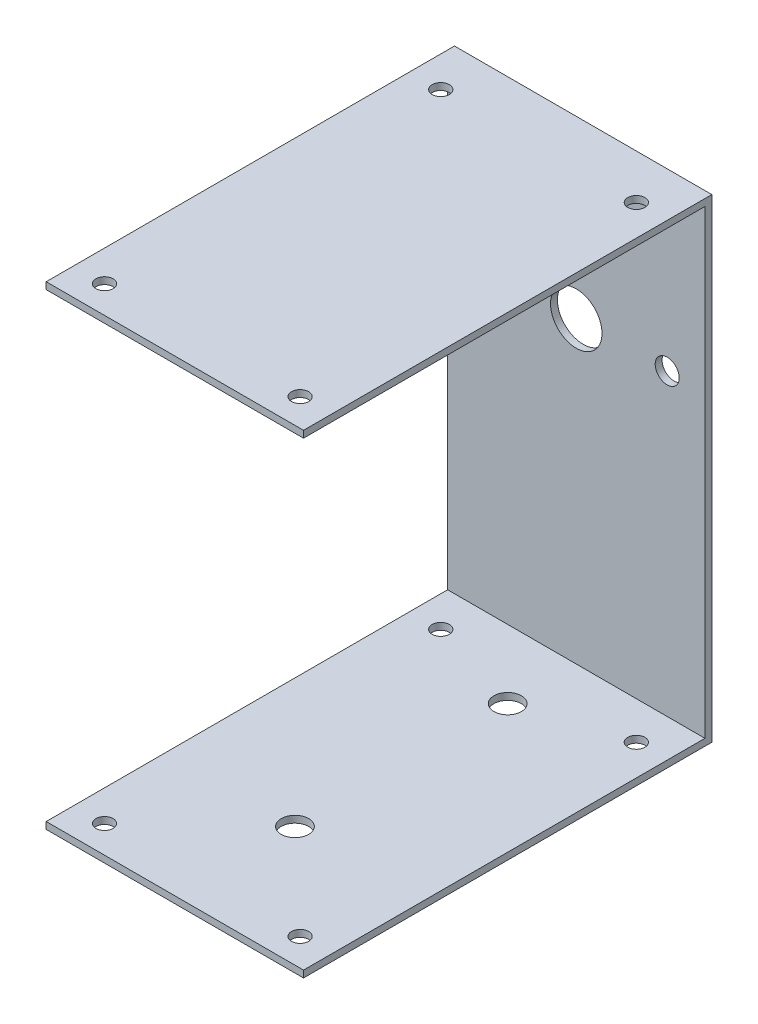
ISO-10303-21;
HEADER;
FILE_DESCRIPTION(('STEP AP214'),'2;1');
FILE_NAME('part.step','',(''),(''),'','','');
FILE_SCHEMA(('AUTOMOTIVE_DESIGN { 1 0 10303 214 1 1 1 1 }'));
ENDSEC;
DATA;
#1=APPLICATION_CONTEXT('core data for automotive mechanical design processes');
#2=APPLICATION_PROTOCOL_DEFINITION('international standard','automotive_design',2000,#1);
#3=PRODUCT_CONTEXT('',#1,'mechanical');
#4=PRODUCT('Part','Part','',(#3));
#5=PRODUCT_RELATED_PRODUCT_CATEGORY('part','',(#4));
#6=PRODUCT_DEFINITION_FORMATION('','',#4);
#7=PRODUCT_DEFINITION_CONTEXT('part definition',#1,'design');
#8=PRODUCT_DEFINITION('design','',#6,#7);
#9=PRODUCT_DEFINITION_SHAPE('','',#8);
#10=(LENGTH_UNIT() NAMED_UNIT(*) SI_UNIT(.MILLI.,.METRE.));
#11=(NAMED_UNIT(*) PLANE_ANGLE_UNIT() SI_UNIT($,.RADIAN.));
#12=(NAMED_UNIT(*) SI_UNIT($,.STERADIAN.) SOLID_ANGLE_UNIT());
#13=UNCERTAINTY_MEASURE_WITH_UNIT(LENGTH_MEASURE(1.E-05),#10,'distance_accuracy_value','');
#14=(GEOMETRIC_REPRESENTATION_CONTEXT(3) GLOBAL_UNCERTAINTY_ASSIGNED_CONTEXT((#13)) GLOBAL_UNIT_ASSIGNED_CONTEXT((#10,
#11,#12)) REPRESENTATION_CONTEXT('',''));
#15=CARTESIAN_POINT('',(0.,0.,0.));
#16=DIRECTION('',(0.,0.,1.));
#17=DIRECTION('',(1.,0.,0.));
#18=AXIS2_PLACEMENT_3D('',#15,#16,#17);
#19=CARTESIAN_POINT('',(37.5,2.,-58.5));
#20=DIRECTION('',(-1.,0.,0.));
#21=DIRECTION('',(0.,0.,1.));
#22=AXIS2_PLACEMENT_3D('',#19,#20,#21);
#23=PLANE('',#22);
#24=DIRECTION('',(0.,0.,-1.));
#25=VECTOR('',#24,1.);
#26=CARTESIAN_POINT('',(37.5,0.,-58.5));
#27=LINE('',#26,#25);
#28=CARTESIAN_POINT('',(37.5,0.,58.5));
#29=VERTEX_POINT('',#28);
#30=CARTESIAN_POINT('',(37.5,0.,-60.5));
#31=VERTEX_POINT('',#30);
#32=EDGE_CURVE('E96',#29,#31,#27,.T.);
#33=ORIENTED_EDGE('',*,*,#32,.T.);
#34=DIRECTION('',(0.,-1.,0.));
#35=VECTOR('',#34,1.);
#36=CARTESIAN_POINT('',(37.5,136.25,-60.5));
#37=LINE('',#36,#35);
#38=CARTESIAN_POINT('',(37.5,138.25,-60.5));
#39=VERTEX_POINT('',#38);
#40=EDGE_CURVE('E259',#39,#31,#37,.T.);
#41=ORIENTED_EDGE('',*,*,#40,.F.);
#42=DIRECTION('',(0.,0.,-1.));
#43=VECTOR('',#42,1.);
#44=CARTESIAN_POINT('',(37.5,138.25,58.5));
#45=LINE('',#44,#43);
#46=CARTESIAN_POINT('',(37.5,138.25,58.5));
#47=VERTEX_POINT('',#46);
#48=EDGE_CURVE('E229',#47,#39,#45,.T.);
#49=ORIENTED_EDGE('',*,*,#48,.F.);
#50=DIRECTION('',(0.,-1.,0.));
#51=VECTOR('',#50,1.);
#52=CARTESIAN_POINT('',(37.5,138.25,58.5));
#53=LINE('',#52,#51);
#54=CARTESIAN_POINT('',(37.5,136.25,58.5));
#55=VERTEX_POINT('',#54);
#56=EDGE_CURVE('E233',#47,#55,#53,.T.);
#57=ORIENTED_EDGE('',*,*,#56,.T.);
#58=DIRECTION('',(0.,0.,-1.));
#59=VECTOR('',#58,1.);
#60=CARTESIAN_POINT('',(37.5,136.25,58.5));
#61=LINE('',#60,#59);
#62=CARTESIAN_POINT('',(37.5,136.25,-58.5));
#63=VERTEX_POINT('',#62);
#64=EDGE_CURVE('E221',#55,#63,#61,.T.);
#65=ORIENTED_EDGE('',*,*,#64,.T.);
#66=DIRECTION('',(0.,-1.,0.));
#67=VECTOR('',#66,1.);
#68=CARTESIAN_POINT('',(37.5,136.25,-58.5));
#69=LINE('',#68,#67);
#70=CARTESIAN_POINT('',(37.5,2.,-58.5));
#71=VERTEX_POINT('',#70);
#72=EDGE_CURVE('E97',#63,#71,#69,.T.);
#73=ORIENTED_EDGE('',*,*,#72,.T.);
#74=DIRECTION('',(0.,0.,-1.));
#75=VECTOR('',#74,1.);
#76=CARTESIAN_POINT('',(37.5,2.,-58.5));
#77=LINE('',#76,#75);
#78=CARTESIAN_POINT('',(37.5,2.,58.5));
#79=VERTEX_POINT('',#78);
#80=EDGE_CURVE('E102',#79,#71,#77,.T.);
#81=ORIENTED_EDGE('',*,*,#80,.F.);
#82=DIRECTION('',(0.,-1.,0.));
#83=VECTOR('',#82,1.);
#84=CARTESIAN_POINT('',(37.5,2.,58.5));
#85=LINE('',#84,#83);
#86=EDGE_CURVE('E50',#79,#29,#85,.T.);
#87=ORIENTED_EDGE('',*,*,#86,.T.);
#88=EDGE_LOOP('',(#33,#41,#49,#57,#65,#73,#81,#87));
#89=FACE_BOUND('',#88,.T.);
#90=ADVANCED_FACE('F40',(#89),#23,.F.);
#91=CARTESIAN_POINT('',(-37.5,2.,-58.5));
#92=DIRECTION('',(1.,0.,0.));
#93=DIRECTION('',(0.,0.,-1.));
#94=AXIS2_PLACEMENT_3D('',#91,#92,#93);
#95=PLANE('',#94);
#96=DIRECTION('',(0.,0.,1.));
#97=VECTOR('',#96,1.);
#98=CARTESIAN_POINT('',(-37.5,0.,-58.5));
#99=LINE('',#98,#97);
#100=CARTESIAN_POINT('',(-37.5,0.,-60.5));
#101=VERTEX_POINT('',#100);
#102=CARTESIAN_POINT('',(-37.5,0.,58.5));
#103=VERTEX_POINT('',#102);
#104=EDGE_CURVE('E71',#101,#103,#99,.T.);
#105=ORIENTED_EDGE('',*,*,#104,.T.);
#106=DIRECTION('',(0.,-1.,0.));
#107=VECTOR('',#106,1.);
#108=CARTESIAN_POINT('',(-37.5,2.,58.5));
#109=LINE('',#108,#107);
#110=CARTESIAN_POINT('',(-37.5,2.,58.5));
#111=VERTEX_POINT('',#110);
#112=EDGE_CURVE('E11',#111,#103,#109,.T.);
#113=ORIENTED_EDGE('',*,*,#112,.F.);
#114=DIRECTION('',(0.,0.,1.));
#115=VECTOR('',#114,1.);
#116=CARTESIAN_POINT('',(-37.5,2.,-58.5));
#117=LINE('',#116,#115);
#118=CARTESIAN_POINT('',(-37.5,2.,-58.5));
#119=VERTEX_POINT('',#118);
#120=EDGE_CURVE('E100',#119,#111,#117,.T.);
#121=ORIENTED_EDGE('',*,*,#120,.F.);
#122=DIRECTION('',(0.,-1.,0.));
#123=VECTOR('',#122,1.);
#124=CARTESIAN_POINT('',(-37.5,136.25,-58.5));
#125=LINE('',#124,#123);
#126=CARTESIAN_POINT('',(-37.5,136.25,-58.5));
#127=VERTEX_POINT('',#126);
#128=EDGE_CURVE('E88',#127,#119,#125,.T.);
#129=ORIENTED_EDGE('',*,*,#128,.F.);
#130=DIRECTION('',(0.,0.,1.));
#131=VECTOR('',#130,1.);
#132=CARTESIAN_POINT('',(-37.5,136.25,-60.5));
#133=LINE('',#132,#131);
#134=CARTESIAN_POINT('',(-37.5,136.25,58.5));
#135=VERTEX_POINT('',#134);
#136=EDGE_CURVE('E215',#127,#135,#133,.T.);
#137=ORIENTED_EDGE('',*,*,#136,.T.);
#138=DIRECTION('',(0.,-1.,0.));
#139=VECTOR('',#138,1.);
#140=CARTESIAN_POINT('',(-37.5,138.25,58.5));
#141=LINE('',#140,#139);
#142=CARTESIAN_POINT('',(-37.5,138.25,58.5));
#143=VERTEX_POINT('',#142);
#144=EDGE_CURVE('E246',#143,#135,#141,.T.);
#145=ORIENTED_EDGE('',*,*,#144,.F.);
#146=DIRECTION('',(0.,0.,1.));
#147=VECTOR('',#146,1.);
#148=CARTESIAN_POINT('',(-37.5,138.25,-60.5));
#149=LINE('',#148,#147);
#150=CARTESIAN_POINT('',(-37.5,138.25,-60.5));
#151=VERTEX_POINT('',#150);
#152=EDGE_CURVE('E220',#151,#143,#149,.T.);
#153=ORIENTED_EDGE('',*,*,#152,.F.);
#154=DIRECTION('',(0.,-1.,0.));
#155=VECTOR('',#154,1.);
#156=CARTESIAN_POINT('',(-37.5,136.25,-60.5));
#157=LINE('',#156,#155);
#158=EDGE_CURVE('E253',#151,#101,#157,.T.);
#159=ORIENTED_EDGE('',*,*,#158,.T.);
#160=EDGE_LOOP('',(#105,#113,#121,#129,#137,#145,#153,#159));
#161=FACE_BOUND('',#160,.T.);
#162=ADVANCED_FACE('F105',(#161),#95,.F.);
#163=CARTESIAN_POINT('',(-37.5,2.,58.5));
#164=DIRECTION('',(0.,0.,-1.));
#165=DIRECTION('',(-1.,0.,0.));
#166=AXIS2_PLACEMENT_3D('',#163,#164,#165);
#167=PLANE('',#166);
#168=DIRECTION('',(1.,0.,0.));
#169=VECTOR('',#168,1.);
#170=CARTESIAN_POINT('',(-37.5,0.,58.5));
#171=LINE('',#170,#169);
#172=EDGE_CURVE('E117',#103,#29,#171,.T.);
#173=ORIENTED_EDGE('',*,*,#172,.T.);
#174=ORIENTED_EDGE('',*,*,#86,.F.);
#175=DIRECTION('',(1.,0.,0.));
#176=VECTOR('',#175,1.);
#177=CARTESIAN_POINT('',(-37.5,2.,58.5));
#178=LINE('',#177,#176);
#179=EDGE_CURVE('E59',#111,#79,#178,.T.);
#180=ORIENTED_EDGE('',*,*,#179,.F.);
#181=ORIENTED_EDGE('',*,*,#112,.T.);
#182=EDGE_LOOP('',(#173,#174,#180,#181));
#183=FACE_BOUND('',#182,.T.);
#184=ADVANCED_FACE('F320',(#183),#167,.F.);
#185=CARTESIAN_POINT('',(0.,2.,0.));
#186=DIRECTION('',(0.,1.,0.));
#187=DIRECTION('',(0.,0.,1.));
#188=AXIS2_PLACEMENT_3D('',#185,#186,#187);
#189=PLANE('',#188);
#190=CARTESIAN_POINT('',(0.,2.,-38.5));
#191=DIRECTION('',(0.,1.,0.));
#192=DIRECTION('',(0.,0.,1.));
#193=AXIS2_PLACEMENT_3D('',#190,#191,#192);
#194=CIRCLE('',#193,4.);
#195=CARTESIAN_POINT('',(0.,2.,-34.5));
#196=VERTEX_POINT('',#195);
#197=EDGE_CURVE('E139',#196,#196,#194,.T.);
#198=ORIENTED_EDGE('',*,*,#197,.F.);
#199=EDGE_LOOP('',(#198));
#200=FACE_BOUND('',#199,.T.);
#201=CARTESIAN_POINT('',(0.,2.,23.5));
#202=DIRECTION('',(0.,1.,0.));
#203=DIRECTION('',(0.,0.,1.));
#204=AXIS2_PLACEMENT_3D('',#201,#202,#203);
#205=CIRCLE('',#204,4.);
#206=CARTESIAN_POINT('',(0.,2.,27.5));
#207=VERTEX_POINT('',#206);
#208=EDGE_CURVE('E341',#207,#207,#205,.T.);
#209=ORIENTED_EDGE('',*,*,#208,.F.);
#210=EDGE_LOOP('',(#209));
#211=FACE_BOUND('',#210,.T.);
#212=CARTESIAN_POINT('',(-28.5,2.,-47.5));
#213=DIRECTION('',(0.,1.,0.));
#214=DIRECTION('',(0.,0.,1.));
#215=AXIS2_PLACEMENT_3D('',#212,#213,#214);
#216=CIRCLE('',#215,2.5);
#217=CARTESIAN_POINT('',(-28.5,2.,-45.));
#218=VERTEX_POINT('',#217);
#219=EDGE_CURVE('E211',#218,#218,#216,.T.);
#220=ORIENTED_EDGE('',*,*,#219,.F.);
#221=EDGE_LOOP('',(#220));
#222=FACE_BOUND('',#221,.T.);
#223=CARTESIAN_POINT('',(28.5,2.,50.5));
#224=DIRECTION('',(0.,1.,0.));
#225=DIRECTION('',(0.,0.,1.));
#226=AXIS2_PLACEMENT_3D('',#223,#224,#225);
#227=CIRCLE('',#226,2.5);
#228=CARTESIAN_POINT('',(28.5,2.,53.));
#229=VERTEX_POINT('',#228);
#230=EDGE_CURVE('E203',#229,#229,#227,.T.);
#231=ORIENTED_EDGE('',*,*,#230,.F.);
#232=EDGE_LOOP('',(#231));
#233=FACE_BOUND('',#232,.T.);
#234=CARTESIAN_POINT('',(-28.5,2.,50.5));
#235=DIRECTION('',(0.,1.,0.));
#236=DIRECTION('',(0.,0.,1.));
#237=AXIS2_PLACEMENT_3D('',#234,#235,#236);
#238=CIRCLE('',#237,2.5);
#239=CARTESIAN_POINT('',(-28.5,2.,53.));
#240=VERTEX_POINT('',#239);
#241=EDGE_CURVE('E195',#240,#240,#238,.T.);
#242=ORIENTED_EDGE('',*,*,#241,.F.);
#243=EDGE_LOOP('',(#242));
#244=FACE_BOUND('',#243,.T.);
#245=CARTESIAN_POINT('',(28.5,2.,-47.5));
#246=DIRECTION('',(0.,1.,0.));
#247=DIRECTION('',(0.,0.,1.));
#248=AXIS2_PLACEMENT_3D('',#245,#246,#247);
#249=CIRCLE('',#248,2.5);
#250=CARTESIAN_POINT('',(28.5,2.,-45.));
#251=VERTEX_POINT('',#250);
#252=EDGE_CURVE('E187',#251,#251,#249,.T.);
#253=ORIENTED_EDGE('',*,*,#252,.F.);
#254=EDGE_LOOP('',(#253));
#255=FACE_BOUND('',#254,.T.);
#256=ORIENTED_EDGE('',*,*,#80,.T.);
#257=DIRECTION('',(-1.,0.,0.));
#258=VECTOR('',#257,1.);
#259=CARTESIAN_POINT('',(-37.5,2.,-58.5));
#260=LINE('',#259,#258);
#261=EDGE_CURVE('E80',#71,#119,#260,.T.);
#262=ORIENTED_EDGE('',*,*,#261,.T.);
#263=ORIENTED_EDGE('',*,*,#120,.T.);
#264=ORIENTED_EDGE('',*,*,#179,.T.);
#265=EDGE_LOOP('',(#256,#262,#263,#264));
#266=FACE_BOUND('',#265,.T.);
#267=ADVANCED_FACE('F99',(#200,#211,#222,#233,#244,#255,#266),#189,.T.);
#268=CARTESIAN_POINT('',(0.,0.,0.));
#269=DIRECTION('',(0.,1.,0.));
#270=DIRECTION('',(0.,0.,1.));
#271=AXIS2_PLACEMENT_3D('',#268,#269,#270);
#272=PLANE('',#271);
#273=CARTESIAN_POINT('',(0.,0.,-38.5));
#274=DIRECTION('',(0.,-1.,0.));
#275=DIRECTION('',(0.,0.,-1.));
#276=AXIS2_PLACEMENT_3D('',#273,#274,#275);
#277=CIRCLE('',#276,4.);
#278=CARTESIAN_POINT('',(0.,0.,-42.5));
#279=VERTEX_POINT('',#278);
#280=EDGE_CURVE('E443',#279,#279,#277,.T.);
#281=ORIENTED_EDGE('',*,*,#280,.F.);
#282=EDGE_LOOP('',(#281));
#283=FACE_BOUND('',#282,.T.);
#284=CARTESIAN_POINT('',(0.,0.,23.5));
#285=DIRECTION('',(0.,-1.,0.));
#286=DIRECTION('',(0.,0.,-1.));
#287=AXIS2_PLACEMENT_3D('',#284,#285,#286);
#288=CIRCLE('',#287,4.);
#289=CARTESIAN_POINT('',(0.,0.,19.5));
#290=VERTEX_POINT('',#289);
#291=EDGE_CURVE('E445',#290,#290,#288,.T.);
#292=ORIENTED_EDGE('',*,*,#291,.F.);
#293=EDGE_LOOP('',(#292));
#294=FACE_BOUND('',#293,.T.);
#295=CARTESIAN_POINT('',(-28.5,0.,-47.5));
#296=DIRECTION('',(0.,-1.,0.));
#297=DIRECTION('',(0.,0.,-1.));
#298=AXIS2_PLACEMENT_3D('',#295,#296,#297);
#299=CIRCLE('',#298,2.5);
#300=CARTESIAN_POINT('',(-28.5,0.,-50.));
#301=VERTEX_POINT('',#300);
#302=EDGE_CURVE('E165',#301,#301,#299,.T.);
#303=ORIENTED_EDGE('',*,*,#302,.F.);
#304=EDGE_LOOP('',(#303));
#305=FACE_BOUND('',#304,.T.);
#306=CARTESIAN_POINT('',(28.5,0.,50.5));
#307=DIRECTION('',(0.,-1.,0.));
#308=DIRECTION('',(0.,0.,-1.));
#309=AXIS2_PLACEMENT_3D('',#306,#307,#308);
#310=CIRCLE('',#309,2.5);
#311=CARTESIAN_POINT('',(28.5,0.,48.));
#312=VERTEX_POINT('',#311);
#313=EDGE_CURVE('E156',#312,#312,#310,.T.);
#314=ORIENTED_EDGE('',*,*,#313,.F.);
#315=EDGE_LOOP('',(#314));
#316=FACE_BOUND('',#315,.T.);
#317=CARTESIAN_POINT('',(-28.5,0.,50.5));
#318=DIRECTION('',(0.,-1.,0.));
#319=DIRECTION('',(0.,0.,-1.));
#320=AXIS2_PLACEMENT_3D('',#317,#318,#319);
#321=CIRCLE('',#320,2.5);
#322=CARTESIAN_POINT('',(-28.5,0.,48.));
#323=VERTEX_POINT('',#322);
#324=EDGE_CURVE('E151',#323,#323,#321,.T.);
#325=ORIENTED_EDGE('',*,*,#324,.F.);
#326=EDGE_LOOP('',(#325));
#327=FACE_BOUND('',#326,.T.);
#328=CARTESIAN_POINT('',(28.5,0.,-47.5));
#329=DIRECTION('',(0.,-1.,0.));
#330=DIRECTION('',(0.,0.,-1.));
#331=AXIS2_PLACEMENT_3D('',#328,#329,#330);
#332=CIRCLE('',#331,2.5);
#333=CARTESIAN_POINT('',(28.5,0.,-50.));
#334=VERTEX_POINT('',#333);
#335=EDGE_CURVE('E164',#334,#334,#332,.T.);
#336=ORIENTED_EDGE('',*,*,#335,.F.);
#337=EDGE_LOOP('',(#336));
#338=FACE_BOUND('',#337,.T.);
#339=ORIENTED_EDGE('',*,*,#32,.F.);
#340=ORIENTED_EDGE('',*,*,#172,.F.);
#341=ORIENTED_EDGE('',*,*,#104,.F.);
#342=DIRECTION('',(-1.,0.,0.));
#343=VECTOR('',#342,1.);
#344=CARTESIAN_POINT('',(-37.5,0.,-60.5));
#345=LINE('',#344,#343);
#346=EDGE_CURVE('E250',#31,#101,#345,.T.);
#347=ORIENTED_EDGE('',*,*,#346,.F.);
#348=EDGE_LOOP('',(#339,#340,#341,#347));
#349=FACE_BOUND('',#348,.T.);
#350=ADVANCED_FACE('F300',(#283,#294,#305,#316,#327,#338,#349),#272,.F.);
#351=CARTESIAN_POINT('',(-37.5,136.25,-58.5));
#352=DIRECTION('',(0.,0.,-1.));
#353=DIRECTION('',(-1.,0.,0.));
#354=AXIS2_PLACEMENT_3D('',#351,#352,#353);
#355=PLANE('',#354);
#356=CARTESIAN_POINT('',(26.5,89.2,-58.5));
#357=DIRECTION('',(0.,0.,1.));
#358=DIRECTION('',(1.,0.,0.));
#359=AXIS2_PLACEMENT_3D('',#356,#357,#358);
#360=CIRCLE('',#359,3.5);
#361=CARTESIAN_POINT('',(30.,89.2,-58.5));
#362=VERTEX_POINT('',#361);
#363=EDGE_CURVE('E125',#362,#362,#360,.T.);
#364=ORIENTED_EDGE('',*,*,#363,.F.);
#365=EDGE_LOOP('',(#364));
#366=FACE_BOUND('',#365,.T.);
#367=CARTESIAN_POINT('',(-26.5,89.2,-58.5));
#368=DIRECTION('',(0.,0.,1.));
#369=DIRECTION('',(1.,0.,0.));
#370=AXIS2_PLACEMENT_3D('',#367,#368,#369);
#371=CIRCLE('',#370,3.5);
#372=CARTESIAN_POINT('',(-23.,89.2,-58.5));
#373=VERTEX_POINT('',#372);
#374=EDGE_CURVE('E133',#373,#373,#371,.T.);
#375=ORIENTED_EDGE('',*,*,#374,.F.);
#376=EDGE_LOOP('',(#375));
#377=FACE_BOUND('',#376,.T.);
#378=CARTESIAN_POINT('',(0.,89.2,-58.5));
#379=DIRECTION('',(0.,0.,-1.));
#380=DIRECTION('',(-1.,0.,0.));
#381=AXIS2_PLACEMENT_3D('',#378,#379,#380);
#382=CIRCLE('',#381,7.50000000000001);
#383=CARTESIAN_POINT('',(-7.5,89.2,-58.5));
#384=VERTEX_POINT('',#383);
#385=EDGE_CURVE('E147',#384,#384,#382,.T.);
#386=ORIENTED_EDGE('',*,*,#385,.T.);
#387=EDGE_LOOP('',(#386));
#388=FACE_BOUND('',#387,.T.);
#389=ORIENTED_EDGE('',*,*,#261,.F.);
#390=ORIENTED_EDGE('',*,*,#72,.F.);
#391=DIRECTION('',(1.,0.,0.));
#392=VECTOR('',#391,1.);
#393=CARTESIAN_POINT('',(-37.5,136.25,-58.5));
#394=LINE('',#393,#392);
#395=EDGE_CURVE('E91',#127,#63,#394,.T.);
#396=ORIENTED_EDGE('',*,*,#395,.F.);
#397=ORIENTED_EDGE('',*,*,#128,.T.);
#398=EDGE_LOOP('',(#389,#390,#396,#397));
#399=FACE_BOUND('',#398,.T.);
#400=ADVANCED_FACE('F89',(#366,#377,#388,#399),#355,.F.);
#401=CARTESIAN_POINT('',(-37.5,136.25,-60.5));
#402=DIRECTION('',(0.,0.,1.));
#403=DIRECTION('',(1.,0.,0.));
#404=AXIS2_PLACEMENT_3D('',#401,#402,#403);
#405=PLANE('',#404);
#406=CARTESIAN_POINT('',(26.5,89.2,-60.5));
#407=DIRECTION('',(0.,0.,1.));
#408=DIRECTION('',(1.,0.,0.));
#409=AXIS2_PLACEMENT_3D('',#406,#407,#408);
#410=CIRCLE('',#409,3.5);
#411=CARTESIAN_POINT('',(30.,89.2,-60.5));
#412=VERTEX_POINT('',#411);
#413=EDGE_CURVE('E43',#412,#412,#410,.T.);
#414=ORIENTED_EDGE('',*,*,#413,.T.);
#415=EDGE_LOOP('',(#414));
#416=FACE_BOUND('',#415,.T.);
#417=CARTESIAN_POINT('',(-26.5,89.2,-60.5));
#418=DIRECTION('',(0.,0.,1.));
#419=DIRECTION('',(1.,0.,0.));
#420=AXIS2_PLACEMENT_3D('',#417,#418,#419);
#421=CIRCLE('',#420,3.5);
#422=CARTESIAN_POINT('',(-23.,89.2,-60.5));
#423=VERTEX_POINT('',#422);
#424=EDGE_CURVE('E122',#423,#423,#421,.T.);
#425=ORIENTED_EDGE('',*,*,#424,.T.);
#426=EDGE_LOOP('',(#425));
#427=FACE_BOUND('',#426,.T.);
#428=CARTESIAN_POINT('',(0.,89.2,-60.5));
#429=DIRECTION('',(0.,0.,-1.));
#430=DIRECTION('',(-1.,0.,0.));
#431=AXIS2_PLACEMENT_3D('',#428,#429,#430);
#432=CIRCLE('',#431,7.50000000000001);
#433=CARTESIAN_POINT('',(-7.5,89.2,-60.5));
#434=VERTEX_POINT('',#433);
#435=EDGE_CURVE('E131',#434,#434,#432,.T.);
#436=ORIENTED_EDGE('',*,*,#435,.F.);
#437=EDGE_LOOP('',(#436));
#438=FACE_BOUND('',#437,.T.);
#439=ORIENTED_EDGE('',*,*,#346,.T.);
#440=ORIENTED_EDGE('',*,*,#158,.F.);
#441=DIRECTION('',(-1.,0.,0.));
#442=VECTOR('',#441,1.);
#443=CARTESIAN_POINT('',(37.5,138.25,-60.5));
#444=LINE('',#443,#442);
#445=EDGE_CURVE('E216',#39,#151,#444,.T.);
#446=ORIENTED_EDGE('',*,*,#445,.F.);
#447=ORIENTED_EDGE('',*,*,#40,.T.);
#448=EDGE_LOOP('',(#439,#440,#446,#447));
#449=FACE_BOUND('',#448,.T.);
#450=ADVANCED_FACE('F303',(#416,#427,#438,#449),#405,.F.);
#451=CARTESIAN_POINT('',(0.,136.25,0.));
#452=DIRECTION('',(0.,1.,0.));
#453=DIRECTION('',(0.,0.,1.));
#454=AXIS2_PLACEMENT_3D('',#451,#452,#453);
#455=PLANE('',#454);
#456=CARTESIAN_POINT('',(-28.5,136.25,-47.5));
#457=DIRECTION('',(0.,1.,0.));
#458=DIRECTION('',(0.,0.,1.));
#459=AXIS2_PLACEMENT_3D('',#456,#457,#458);
#460=CIRCLE('',#459,2.5);
#461=CARTESIAN_POINT('',(-28.5,136.25,-45.));
#462=VERTEX_POINT('',#461);
#463=EDGE_CURVE('E207',#462,#462,#460,.T.);
#464=ORIENTED_EDGE('',*,*,#463,.T.);
#465=EDGE_LOOP('',(#464));
#466=FACE_BOUND('',#465,.T.);
#467=CARTESIAN_POINT('',(28.5,136.25,50.5));
#468=DIRECTION('',(0.,1.,0.));
#469=DIRECTION('',(0.,0.,1.));
#470=AXIS2_PLACEMENT_3D('',#467,#468,#469);
#471=CIRCLE('',#470,2.5);
#472=CARTESIAN_POINT('',(28.5,136.25,53.));
#473=VERTEX_POINT('',#472);
#474=EDGE_CURVE('E199',#473,#473,#471,.T.);
#475=ORIENTED_EDGE('',*,*,#474,.T.);
#476=EDGE_LOOP('',(#475));
#477=FACE_BOUND('',#476,.T.);
#478=CARTESIAN_POINT('',(-28.5,136.25,50.5));
#479=DIRECTION('',(0.,1.,0.));
#480=DIRECTION('',(0.,0.,1.));
#481=AXIS2_PLACEMENT_3D('',#478,#479,#480);
#482=CIRCLE('',#481,2.5);
#483=CARTESIAN_POINT('',(-28.5,136.25,53.));
#484=VERTEX_POINT('',#483);
#485=EDGE_CURVE('E191',#484,#484,#482,.T.);
#486=ORIENTED_EDGE('',*,*,#485,.T.);
#487=EDGE_LOOP('',(#486));
#488=FACE_BOUND('',#487,.T.);
#489=CARTESIAN_POINT('',(28.5,136.25,-47.5));
#490=DIRECTION('',(0.,1.,0.));
#491=DIRECTION('',(0.,0.,1.));
#492=AXIS2_PLACEMENT_3D('',#489,#490,#491);
#493=CIRCLE('',#492,2.5);
#494=CARTESIAN_POINT('',(28.5,136.25,-45.));
#495=VERTEX_POINT('',#494);
#496=EDGE_CURVE('E180',#495,#495,#493,.T.);
#497=ORIENTED_EDGE('',*,*,#496,.T.);
#498=EDGE_LOOP('',(#497));
#499=FACE_BOUND('',#498,.T.);
#500=ORIENTED_EDGE('',*,*,#136,.F.);
#501=ORIENTED_EDGE('',*,*,#395,.T.);
#502=ORIENTED_EDGE('',*,*,#64,.F.);
#503=DIRECTION('',(1.,0.,0.));
#504=VECTOR('',#503,1.);
#505=CARTESIAN_POINT('',(-37.5,136.25,58.5));
#506=LINE('',#505,#504);
#507=EDGE_CURVE('E236',#135,#55,#506,.T.);
#508=ORIENTED_EDGE('',*,*,#507,.F.);
#509=EDGE_LOOP('',(#500,#501,#502,#508));
#510=FACE_BOUND('',#509,.T.);
#511=ADVANCED_FACE('F272',(#466,#477,#488,#499,#510),#455,.F.);
#512=CARTESIAN_POINT('',(-37.5,138.25,58.5));
#513=DIRECTION('',(0.,0.,-1.));
#514=DIRECTION('',(-1.,0.,0.));
#515=AXIS2_PLACEMENT_3D('',#512,#513,#514);
#516=PLANE('',#515);
#517=ORIENTED_EDGE('',*,*,#507,.T.);
#518=ORIENTED_EDGE('',*,*,#56,.F.);
#519=DIRECTION('',(1.,0.,0.));
#520=VECTOR('',#519,1.);
#521=CARTESIAN_POINT('',(-37.5,138.25,58.5));
#522=LINE('',#521,#520);
#523=EDGE_CURVE('E225',#143,#47,#522,.T.);
#524=ORIENTED_EDGE('',*,*,#523,.F.);
#525=ORIENTED_EDGE('',*,*,#144,.T.);
#526=EDGE_LOOP('',(#517,#518,#524,#525));
#527=FACE_BOUND('',#526,.T.);
#528=ADVANCED_FACE('F282',(#527),#516,.F.);
#529=CARTESIAN_POINT('',(0.,138.25,0.));
#530=DIRECTION('',(0.,1.,0.));
#531=DIRECTION('',(0.,0.,1.));
#532=AXIS2_PLACEMENT_3D('',#529,#530,#531);
#533=PLANE('',#532);
#534=CARTESIAN_POINT('',(-28.5,138.25,-47.5));
#535=DIRECTION('',(0.,-1.,0.));
#536=DIRECTION('',(0.,0.,-1.));
#537=AXIS2_PLACEMENT_3D('',#534,#535,#536);
#538=CIRCLE('',#537,2.5);
#539=CARTESIAN_POINT('',(-28.5,138.25,-50.));
#540=VERTEX_POINT('',#539);
#541=EDGE_CURVE('E160',#540,#540,#538,.T.);
#542=ORIENTED_EDGE('',*,*,#541,.T.);
#543=EDGE_LOOP('',(#542));
#544=FACE_BOUND('',#543,.T.);
#545=CARTESIAN_POINT('',(28.5,138.25,50.5));
#546=DIRECTION('',(0.,-1.,0.));
#547=DIRECTION('',(0.,0.,-1.));
#548=AXIS2_PLACEMENT_3D('',#545,#546,#547);
#549=CIRCLE('',#548,2.5);
#550=CARTESIAN_POINT('',(28.5,138.25,48.));
#551=VERTEX_POINT('',#550);
#552=EDGE_CURVE('E169',#551,#551,#549,.T.);
#553=ORIENTED_EDGE('',*,*,#552,.T.);
#554=EDGE_LOOP('',(#553));
#555=FACE_BOUND('',#554,.T.);
#556=CARTESIAN_POINT('',(-28.5,138.25,50.5));
#557=DIRECTION('',(0.,-1.,0.));
#558=DIRECTION('',(0.,0.,-1.));
#559=AXIS2_PLACEMENT_3D('',#556,#557,#558);
#560=CIRCLE('',#559,2.5);
#561=CARTESIAN_POINT('',(-28.5,138.25,48.));
#562=VERTEX_POINT('',#561);
#563=EDGE_CURVE('E152',#562,#562,#560,.T.);
#564=ORIENTED_EDGE('',*,*,#563,.T.);
#565=EDGE_LOOP('',(#564));
#566=FACE_BOUND('',#565,.T.);
#567=CARTESIAN_POINT('',(28.5,138.25,-47.5));
#568=DIRECTION('',(0.,-1.,0.));
#569=DIRECTION('',(0.,0.,-1.));
#570=AXIS2_PLACEMENT_3D('',#567,#568,#569);
#571=CIRCLE('',#570,2.5);
#572=CARTESIAN_POINT('',(28.5,138.25,-50.));
#573=VERTEX_POINT('',#572);
#574=EDGE_CURVE('E176',#573,#573,#571,.T.);
#575=ORIENTED_EDGE('',*,*,#574,.T.);
#576=EDGE_LOOP('',(#575));
#577=FACE_BOUND('',#576,.T.);
#578=ORIENTED_EDGE('',*,*,#445,.T.);
#579=ORIENTED_EDGE('',*,*,#152,.T.);
#580=ORIENTED_EDGE('',*,*,#523,.T.);
#581=ORIENTED_EDGE('',*,*,#48,.T.);
#582=EDGE_LOOP('',(#578,#579,#580,#581));
#583=FACE_BOUND('',#582,.T.);
#584=ADVANCED_FACE('F289',(#544,#555,#566,#577,#583),#533,.T.);
#585=CARTESIAN_POINT('',(28.5,138.25,-47.5));
#586=DIRECTION('',(0.,-1.,0.));
#587=DIRECTION('',(0.,0.,-1.));
#588=AXIS2_PLACEMENT_3D('',#585,#586,#587);
#589=CYLINDRICAL_SURFACE('',#588,2.5);
#590=ORIENTED_EDGE('',*,*,#574,.F.);
#591=EDGE_LOOP('',(#590));
#592=FACE_BOUND('',#591,.T.);
#593=ORIENTED_EDGE('',*,*,#496,.F.);
#594=EDGE_LOOP('',(#593));
#595=FACE_BOUND('',#594,.T.);
#596=ADVANCED_FACE('F356',(#592,#595),#589,.F.);
#597=CARTESIAN_POINT('',(-28.5,138.25,50.5));
#598=DIRECTION('',(0.,-1.,0.));
#599=DIRECTION('',(0.,0.,-1.));
#600=AXIS2_PLACEMENT_3D('',#597,#598,#599);
#601=CYLINDRICAL_SURFACE('',#600,2.5);
#602=ORIENTED_EDGE('',*,*,#563,.F.);
#603=EDGE_LOOP('',(#602));
#604=FACE_BOUND('',#603,.T.);
#605=ORIENTED_EDGE('',*,*,#485,.F.);
#606=EDGE_LOOP('',(#605));
#607=FACE_BOUND('',#606,.T.);
#608=ADVANCED_FACE('F366',(#604,#607),#601,.F.);
#609=CARTESIAN_POINT('',(28.5,138.25,50.5));
#610=DIRECTION('',(0.,-1.,0.));
#611=DIRECTION('',(0.,0.,-1.));
#612=AXIS2_PLACEMENT_3D('',#609,#610,#611);
#613=CYLINDRICAL_SURFACE('',#612,2.5);
#614=ORIENTED_EDGE('',*,*,#552,.F.);
#615=EDGE_LOOP('',(#614));
#616=FACE_BOUND('',#615,.T.);
#617=ORIENTED_EDGE('',*,*,#474,.F.);
#618=EDGE_LOOP('',(#617));
#619=FACE_BOUND('',#618,.T.);
#620=ADVANCED_FACE('F367',(#616,#619),#613,.F.);
#621=CARTESIAN_POINT('',(-28.5,138.25,-47.5));
#622=DIRECTION('',(0.,-1.,0.));
#623=DIRECTION('',(0.,0.,-1.));
#624=AXIS2_PLACEMENT_3D('',#621,#622,#623);
#625=CYLINDRICAL_SURFACE('',#624,2.5);
#626=ORIENTED_EDGE('',*,*,#541,.F.);
#627=EDGE_LOOP('',(#626));
#628=FACE_BOUND('',#627,.T.);
#629=ORIENTED_EDGE('',*,*,#463,.F.);
#630=EDGE_LOOP('',(#629));
#631=FACE_BOUND('',#630,.T.);
#632=ADVANCED_FACE('F354',(#628,#631),#625,.F.);
#633=ORIENTED_EDGE('',*,*,#252,.T.);
#634=EDGE_LOOP('',(#633));
#635=FACE_BOUND('',#634,.T.);
#636=ORIENTED_EDGE('',*,*,#335,.T.);
#637=EDGE_LOOP('',(#636));
#638=FACE_BOUND('',#637,.T.);
#639=ADVANCED_FACE('F350',(#635,#638),#589,.F.);
#640=ORIENTED_EDGE('',*,*,#241,.T.);
#641=EDGE_LOOP('',(#640));
#642=FACE_BOUND('',#641,.T.);
#643=ORIENTED_EDGE('',*,*,#324,.T.);
#644=EDGE_LOOP('',(#643));
#645=FACE_BOUND('',#644,.T.);
#646=ADVANCED_FACE('F353',(#642,#645),#601,.F.);
#647=ORIENTED_EDGE('',*,*,#230,.T.);
#648=EDGE_LOOP('',(#647));
#649=FACE_BOUND('',#648,.T.);
#650=ORIENTED_EDGE('',*,*,#313,.T.);
#651=EDGE_LOOP('',(#650));
#652=FACE_BOUND('',#651,.T.);
#653=ADVANCED_FACE('F363',(#649,#652),#613,.F.);
#654=ORIENTED_EDGE('',*,*,#219,.T.);
#655=EDGE_LOOP('',(#654));
#656=FACE_BOUND('',#655,.T.);
#657=ORIENTED_EDGE('',*,*,#302,.T.);
#658=EDGE_LOOP('',(#657));
#659=FACE_BOUND('',#658,.T.);
#660=ADVANCED_FACE('F370',(#656,#659),#625,.F.);
#661=CARTESIAN_POINT('',(0.,89.2,-50.5));
#662=DIRECTION('',(0.,0.,-1.));
#663=DIRECTION('',(-1.,0.,0.));
#664=AXIS2_PLACEMENT_3D('',#661,#662,#663);
#665=CYLINDRICAL_SURFACE('',#664,7.50000000000001);
#666=ORIENTED_EDGE('',*,*,#435,.T.);
#667=EDGE_LOOP('',(#666));
#668=FACE_BOUND('',#667,.T.);
#669=ORIENTED_EDGE('',*,*,#385,.F.);
#670=EDGE_LOOP('',(#669));
#671=FACE_BOUND('',#670,.T.);
#672=ADVANCED_FACE('F409',(#668,#671),#665,.F.);
#673=CARTESIAN_POINT('',(-26.5,89.2,-68.5));
#674=DIRECTION('',(0.,0.,1.));
#675=DIRECTION('',(1.,0.,0.));
#676=AXIS2_PLACEMENT_3D('',#673,#674,#675);
#677=CYLINDRICAL_SURFACE('',#676,3.5);
#678=ORIENTED_EDGE('',*,*,#374,.T.);
#679=EDGE_LOOP('',(#678));
#680=FACE_BOUND('',#679,.T.);
#681=ORIENTED_EDGE('',*,*,#424,.F.);
#682=EDGE_LOOP('',(#681));
#683=FACE_BOUND('',#682,.T.);
#684=ADVANCED_FACE('F420',(#680,#683),#677,.F.);
#685=CARTESIAN_POINT('',(26.5,89.2,-68.5));
#686=DIRECTION('',(0.,0.,1.));
#687=DIRECTION('',(1.,0.,0.));
#688=AXIS2_PLACEMENT_3D('',#685,#686,#687);
#689=CYLINDRICAL_SURFACE('',#688,3.5);
#690=ORIENTED_EDGE('',*,*,#363,.T.);
#691=EDGE_LOOP('',(#690));
#692=FACE_BOUND('',#691,.T.);
#693=ORIENTED_EDGE('',*,*,#413,.F.);
#694=EDGE_LOOP('',(#693));
#695=FACE_BOUND('',#694,.T.);
#696=ADVANCED_FACE('F427',(#692,#695),#689,.F.);
#697=CARTESIAN_POINT('',(0.,10.,23.5));
#698=DIRECTION('',(0.,-1.,0.));
#699=DIRECTION('',(0.,0.,-1.));
#700=AXIS2_PLACEMENT_3D('',#697,#698,#699);
#701=CYLINDRICAL_SURFACE('',#700,4.);
#702=ORIENTED_EDGE('',*,*,#208,.T.);
#703=EDGE_LOOP('',(#702));
#704=FACE_BOUND('',#703,.T.);
#705=ORIENTED_EDGE('',*,*,#291,.T.);
#706=EDGE_LOOP('',(#705));
#707=FACE_BOUND('',#706,.T.);
#708=ADVANCED_FACE('F431',(#704,#707),#701,.F.);
#709=CARTESIAN_POINT('',(0.,10.,-38.5));
#710=DIRECTION('',(0.,-1.,0.));
#711=DIRECTION('',(0.,0.,-1.));
#712=AXIS2_PLACEMENT_3D('',#709,#710,#711);
#713=CYLINDRICAL_SURFACE('',#712,4.);
#714=ORIENTED_EDGE('',*,*,#197,.T.);
#715=EDGE_LOOP('',(#714));
#716=FACE_BOUND('',#715,.T.);
#717=ORIENTED_EDGE('',*,*,#280,.T.);
#718=EDGE_LOOP('',(#717));
#719=FACE_BOUND('',#718,.T.);
#720=ADVANCED_FACE('F434',(#716,#719),#713,.F.);
#721=CLOSED_SHELL('',(#90,#162,#184,#267,#350,#400,#450,#511,#528,#584,#596,#608,#620,#632,#639,
#646,#653,#660,#672,#684,#696,#708,#720));
#722=MANIFOLD_SOLID_BREP('B2',#721);
#723=ADVANCED_BREP_SHAPE_REPRESENTATION('',(#18,#722),#14);
#724=SHAPE_DEFINITION_REPRESENTATION(#9,#723);
ENDSEC;
END-ISO-10303-21;
